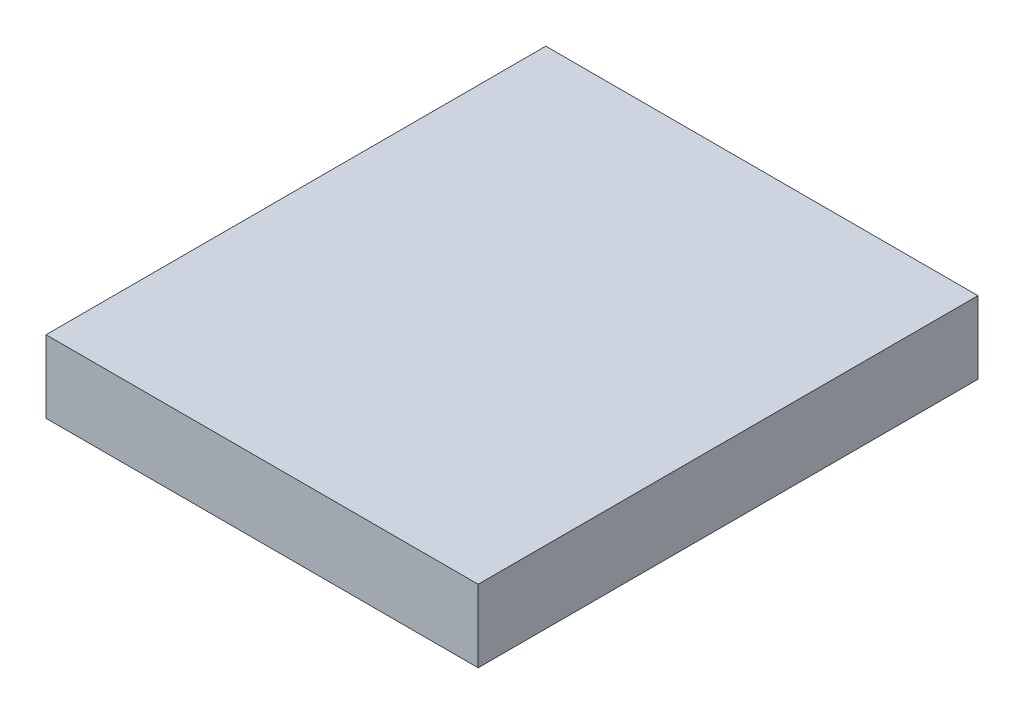
ISO-10303-21;
HEADER;
FILE_DESCRIPTION(('STEP AP214'),'2;1');
FILE_NAME('part.step','',(''),(''),'','','');
FILE_SCHEMA(('AUTOMOTIVE_DESIGN { 1 0 10303 214 1 1 1 1 }'));
ENDSEC;
DATA;
#1=APPLICATION_CONTEXT('core data for automotive mechanical design processes');
#2=APPLICATION_PROTOCOL_DEFINITION('international standard','automotive_design',2000,#1);
#3=PRODUCT_CONTEXT('',#1,'mechanical');
#4=PRODUCT('Part','Part','',(#3));
#5=PRODUCT_RELATED_PRODUCT_CATEGORY('part','',(#4));
#6=PRODUCT_DEFINITION_FORMATION('','',#4);
#7=PRODUCT_DEFINITION_CONTEXT('part definition',#1,'design');
#8=PRODUCT_DEFINITION('design','',#6,#7);
#9=PRODUCT_DEFINITION_SHAPE('','',#8);
#10=(LENGTH_UNIT() NAMED_UNIT(*) SI_UNIT(.MILLI.,.METRE.));
#11=(NAMED_UNIT(*) PLANE_ANGLE_UNIT() SI_UNIT($,.RADIAN.));
#12=(NAMED_UNIT(*) SI_UNIT($,.STERADIAN.) SOLID_ANGLE_UNIT());
#13=UNCERTAINTY_MEASURE_WITH_UNIT(LENGTH_MEASURE(1.E-05),#10,'distance_accuracy_value','');
#14=(GEOMETRIC_REPRESENTATION_CONTEXT(3) GLOBAL_UNCERTAINTY_ASSIGNED_CONTEXT((#13)) GLOBAL_UNIT_ASSIGNED_CONTEXT((#10,
#11,#12)) REPRESENTATION_CONTEXT('',''));
#15=CARTESIAN_POINT('',(0.,0.,0.));
#16=DIRECTION('',(0.,0.,1.));
#17=DIRECTION('',(1.,0.,0.));
#18=AXIS2_PLACEMENT_3D('',#15,#16,#17);
#19=CARTESIAN_POINT('',(0.,5.82,0.));
#20=DIRECTION('',(1.,0.,0.));
#21=DIRECTION('',(0.,0.,-1.));
#22=AXIS2_PLACEMENT_3D('',#19,#20,#21);
#23=PLANE('',#22);
#24=DIRECTION('',(0.,0.,1.));
#25=VECTOR('',#24,1.);
#26=CARTESIAN_POINT('',(0.,0.,0.));
#27=LINE('',#26,#25);
#28=CARTESIAN_POINT('',(0.,0.,-40.19));
#29=VERTEX_POINT('',#28);
#30=CARTESIAN_POINT('',(0.,0.,0.));
#31=VERTEX_POINT('',#30);
#32=EDGE_CURVE('E95',#29,#31,#27,.T.);
#33=ORIENTED_EDGE('',*,*,#32,.T.);
#34=DIRECTION('',(0.,-1.,0.));
#35=VECTOR('',#34,1.);
#36=CARTESIAN_POINT('',(0.,5.82,0.));
#37=LINE('',#36,#35);
#38=CARTESIAN_POINT('',(0.,5.82,0.));
#39=VERTEX_POINT('',#38);
#40=EDGE_CURVE('E11',#39,#31,#37,.T.);
#41=ORIENTED_EDGE('',*,*,#40,.F.);
#42=DIRECTION('',(0.,0.,1.));
#43=VECTOR('',#42,1.);
#44=CARTESIAN_POINT('',(0.,5.82,0.));
#45=LINE('',#44,#43);
#46=CARTESIAN_POINT('',(0.,5.82,-40.19));
#47=VERTEX_POINT('',#46);
#48=EDGE_CURVE('E83',#47,#39,#45,.T.);
#49=ORIENTED_EDGE('',*,*,#48,.F.);
#50=DIRECTION('',(0.,-1.,0.));
#51=VECTOR('',#50,1.);
#52=CARTESIAN_POINT('',(0.,5.82,-40.19));
#53=LINE('',#52,#51);
#54=EDGE_CURVE('E91',#47,#29,#53,.T.);
#55=ORIENTED_EDGE('',*,*,#54,.T.);
#56=EDGE_LOOP('',(#33,#41,#49,#55));
#57=FACE_BOUND('',#56,.T.);
#58=ADVANCED_FACE('F32',(#57),#23,.F.);
#59=CARTESIAN_POINT('',(0.,5.82,0.));
#60=DIRECTION('',(0.,0.,-1.));
#61=DIRECTION('',(-1.,0.,0.));
#62=AXIS2_PLACEMENT_3D('',#59,#60,#61);
#63=PLANE('',#62);
#64=DIRECTION('',(1.,0.,0.));
#65=VECTOR('',#64,1.);
#66=CARTESIAN_POINT('',(0.,0.,0.));
#67=LINE('',#66,#65);
#68=CARTESIAN_POINT('',(34.75,0.,0.));
#69=VERTEX_POINT('',#68);
#70=EDGE_CURVE('E87',#31,#69,#67,.T.);
#71=ORIENTED_EDGE('',*,*,#70,.T.);
#72=DIRECTION('',(0.,-1.,0.));
#73=VECTOR('',#72,1.);
#74=CARTESIAN_POINT('',(34.75,5.82,0.));
#75=LINE('',#74,#73);
#76=CARTESIAN_POINT('',(34.75,5.82,0.));
#77=VERTEX_POINT('',#76);
#78=EDGE_CURVE('E40',#77,#69,#75,.T.);
#79=ORIENTED_EDGE('',*,*,#78,.F.);
#80=DIRECTION('',(1.,0.,0.));
#81=VECTOR('',#80,1.);
#82=CARTESIAN_POINT('',(0.,5.82,0.));
#83=LINE('',#82,#81);
#84=EDGE_CURVE('E78',#39,#77,#83,.T.);
#85=ORIENTED_EDGE('',*,*,#84,.F.);
#86=ORIENTED_EDGE('',*,*,#40,.T.);
#87=EDGE_LOOP('',(#71,#79,#85,#86));
#88=FACE_BOUND('',#87,.T.);
#89=ADVANCED_FACE('F86',(#88),#63,.F.);
#90=CARTESIAN_POINT('',(34.75,5.82,0.));
#91=DIRECTION('',(-1.,0.,0.));
#92=DIRECTION('',(0.,0.,1.));
#93=AXIS2_PLACEMENT_3D('',#90,#91,#92);
#94=PLANE('',#93);
#95=DIRECTION('',(0.,0.,-1.));
#96=VECTOR('',#95,1.);
#97=CARTESIAN_POINT('',(34.75,0.,0.));
#98=LINE('',#97,#96);
#99=CARTESIAN_POINT('',(34.75,0.,-40.19));
#100=VERTEX_POINT('',#99);
#101=EDGE_CURVE('E65',#69,#100,#98,.T.);
#102=ORIENTED_EDGE('',*,*,#101,.T.);
#103=DIRECTION('',(0.,-1.,0.));
#104=VECTOR('',#103,1.);
#105=CARTESIAN_POINT('',(34.75,5.82,-40.19));
#106=LINE('',#105,#104);
#107=CARTESIAN_POINT('',(34.75,5.82,-40.19));
#108=VERTEX_POINT('',#107);
#109=EDGE_CURVE('E88',#108,#100,#106,.T.);
#110=ORIENTED_EDGE('',*,*,#109,.F.);
#111=DIRECTION('',(0.,0.,-1.));
#112=VECTOR('',#111,1.);
#113=CARTESIAN_POINT('',(34.75,5.82,0.));
#114=LINE('',#113,#112);
#115=EDGE_CURVE('E81',#77,#108,#114,.T.);
#116=ORIENTED_EDGE('',*,*,#115,.F.);
#117=ORIENTED_EDGE('',*,*,#78,.T.);
#118=EDGE_LOOP('',(#102,#110,#116,#117));
#119=FACE_BOUND('',#118,.T.);
#120=ADVANCED_FACE('F89',(#119),#94,.F.);
#121=CARTESIAN_POINT('',(0.,5.82,-40.19));
#122=DIRECTION('',(0.,0.,1.));
#123=DIRECTION('',(1.,0.,0.));
#124=AXIS2_PLACEMENT_3D('',#121,#122,#123);
#125=PLANE('',#124);
#126=DIRECTION('',(-1.,0.,0.));
#127=VECTOR('',#126,1.);
#128=CARTESIAN_POINT('',(0.,0.,-40.19));
#129=LINE('',#128,#127);
#130=EDGE_CURVE('E71',#100,#29,#129,.T.);
#131=ORIENTED_EDGE('',*,*,#130,.T.);
#132=ORIENTED_EDGE('',*,*,#54,.F.);
#133=DIRECTION('',(-1.,0.,0.));
#134=VECTOR('',#133,1.);
#135=CARTESIAN_POINT('',(0.,5.82,-40.19));
#136=LINE('',#135,#134);
#137=EDGE_CURVE('E48',#108,#47,#136,.T.);
#138=ORIENTED_EDGE('',*,*,#137,.F.);
#139=ORIENTED_EDGE('',*,*,#109,.T.);
#140=EDGE_LOOP('',(#131,#132,#138,#139));
#141=FACE_BOUND('',#140,.T.);
#142=ADVANCED_FACE('F102',(#141),#125,.F.);
#143=CARTESIAN_POINT('',(0.,5.82,0.));
#144=DIRECTION('',(0.,-1.,0.));
#145=DIRECTION('',(0.,0.,-1.));
#146=AXIS2_PLACEMENT_3D('',#143,#144,#145);
#147=PLANE('',#146);
#148=ORIENTED_EDGE('',*,*,#48,.T.);
#149=ORIENTED_EDGE('',*,*,#84,.T.);
#150=ORIENTED_EDGE('',*,*,#115,.T.);
#151=ORIENTED_EDGE('',*,*,#137,.T.);
#152=EDGE_LOOP('',(#148,#149,#150,#151));
#153=FACE_BOUND('',#152,.T.);
#154=ADVANCED_FACE('F79',(#153),#147,.F.);
#155=CARTESIAN_POINT('',(0.,0.,0.));
#156=DIRECTION('',(0.,-1.,0.));
#157=DIRECTION('',(0.,0.,-1.));
#158=AXIS2_PLACEMENT_3D('',#155,#156,#157);
#159=PLANE('',#158);
#160=ORIENTED_EDGE('',*,*,#32,.F.);
#161=ORIENTED_EDGE('',*,*,#130,.F.);
#162=ORIENTED_EDGE('',*,*,#101,.F.);
#163=ORIENTED_EDGE('',*,*,#70,.F.);
#164=EDGE_LOOP('',(#160,#161,#162,#163));
#165=FACE_BOUND('',#164,.T.);
#166=ADVANCED_FACE('F105',(#165),#159,.T.);
#167=CLOSED_SHELL('',(#58,#89,#120,#142,#154,#166));
#168=MANIFOLD_SOLID_BREP('B2',#167);
#169=ADVANCED_BREP_SHAPE_REPRESENTATION('',(#18,#168),#14);
#170=SHAPE_DEFINITION_REPRESENTATION(#9,#169);
ENDSEC;
END-ISO-10303-21;
